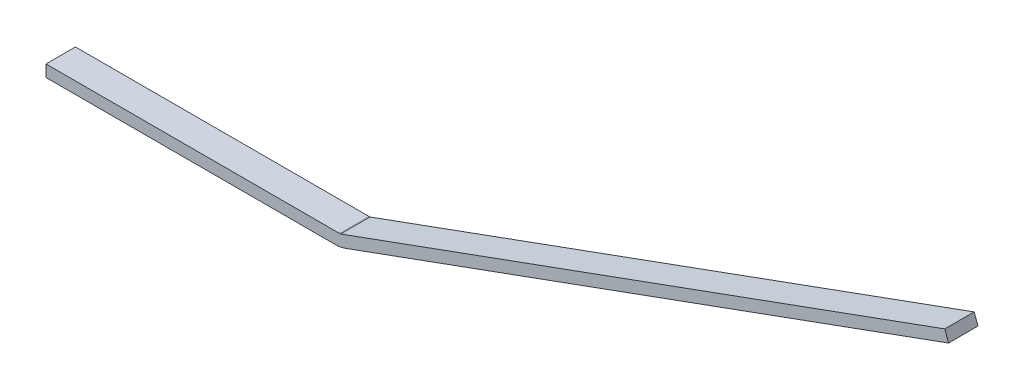
ISO-10303-21;
HEADER;
FILE_DESCRIPTION(('STEP AP214'),'2;1');
FILE_NAME('part.step','',(''),(''),'','','');
FILE_SCHEMA(('AUTOMOTIVE_DESIGN { 1 0 10303 214 1 1 1 1 }'));
ENDSEC;
DATA;
#1=APPLICATION_CONTEXT('core data for automotive mechanical design processes');
#2=APPLICATION_PROTOCOL_DEFINITION('international standard','automotive_design',2000,#1);
#3=PRODUCT_CONTEXT('',#1,'mechanical');
#4=PRODUCT('Part','Part','',(#3));
#5=PRODUCT_RELATED_PRODUCT_CATEGORY('part','',(#4));
#6=PRODUCT_DEFINITION_FORMATION('','',#4);
#7=PRODUCT_DEFINITION_CONTEXT('part definition',#1,'design');
#8=PRODUCT_DEFINITION('design','',#6,#7);
#9=PRODUCT_DEFINITION_SHAPE('','',#8);
#10=(LENGTH_UNIT() NAMED_UNIT(*) SI_UNIT(.MILLI.,.METRE.));
#11=(NAMED_UNIT(*) PLANE_ANGLE_UNIT() SI_UNIT($,.RADIAN.));
#12=(NAMED_UNIT(*) SI_UNIT($,.STERADIAN.) SOLID_ANGLE_UNIT());
#13=UNCERTAINTY_MEASURE_WITH_UNIT(LENGTH_MEASURE(1.E-05),#10,'distance_accuracy_value','');
#14=(GEOMETRIC_REPRESENTATION_CONTEXT(3) GLOBAL_UNCERTAINTY_ASSIGNED_CONTEXT((#13)) GLOBAL_UNIT_ASSIGNED_CONTEXT((#10,
#11,#12)) REPRESENTATION_CONTEXT('',''));
#15=CARTESIAN_POINT('',(0.,0.,0.));
#16=DIRECTION('',(0.,0.,1.));
#17=DIRECTION('',(1.,0.,0.));
#18=AXIS2_PLACEMENT_3D('',#15,#16,#17);
#19=CARTESIAN_POINT('',(-250.,10.,50.));
#20=DIRECTION('',(0.,-1.,0.));
#21=DIRECTION('',(0.,0.,-1.));
#22=AXIS2_PLACEMENT_3D('',#19,#20,#21);
#23=PLANE('',#22);
#24=DIRECTION('',(-1.,0.,0.));
#25=VECTOR('',#24,1.);
#26=CARTESIAN_POINT('',(-250.,10.,50.));
#27=LINE('',#26,#25);
#28=CARTESIAN_POINT('',(248.299352067639,9.99999999999999,50.));
#29=VERTEX_POINT('',#28);
#30=CARTESIAN_POINT('',(-250.,10.,50.));
#31=VERTEX_POINT('',#30);
#32=EDGE_CURVE('E96',#29,#31,#27,.T.);
#33=ORIENTED_EDGE('',*,*,#32,.F.);
#34=DIRECTION('',(0.,0.,1.));
#35=VECTOR('',#34,1.);
#36=CARTESIAN_POINT('',(248.299352067639,10.,50.));
#37=LINE('',#36,#35);
#38=CARTESIAN_POINT('',(248.299352067639,9.99999999999999,0.));
#39=VERTEX_POINT('',#38);
#40=EDGE_CURVE('E115',#29,#39,#37,.F.);
#41=ORIENTED_EDGE('',*,*,#40,.T.);
#42=DIRECTION('',(-1.,0.,0.));
#43=VECTOR('',#42,1.);
#44=CARTESIAN_POINT('',(-250.,10.,0.));
#45=LINE('',#44,#43);
#46=CARTESIAN_POINT('',(-250.,10.,0.));
#47=VERTEX_POINT('',#46);
#48=EDGE_CURVE('E112',#39,#47,#45,.T.);
#49=ORIENTED_EDGE('',*,*,#48,.T.);
#50=DIRECTION('',(0.,0.,-1.));
#51=VECTOR('',#50,1.);
#52=CARTESIAN_POINT('',(-250.,10.,50.));
#53=LINE('',#52,#51);
#54=EDGE_CURVE('E110',#31,#47,#53,.T.);
#55=ORIENTED_EDGE('',*,*,#54,.F.);
#56=EDGE_LOOP('',(#33,#41,#49,#55));
#57=FACE_BOUND('',#56,.T.);
#58=ADVANCED_FACE('F33',(#57),#23,.F.);
#59=CARTESIAN_POINT('',(-250.,-10.,50.));
#60=DIRECTION('',(1.,0.,0.));
#61=DIRECTION('',(0.,0.,-1.));
#62=AXIS2_PLACEMENT_3D('',#59,#60,#61);
#63=PLANE('',#62);
#64=DIRECTION('',(0.,-1.,0.));
#65=VECTOR('',#64,1.);
#66=CARTESIAN_POINT('',(-250.,-10.,0.));
#67=LINE('',#66,#65);
#68=CARTESIAN_POINT('',(-250.,-10.,0.));
#69=VERTEX_POINT('',#68);
#70=EDGE_CURVE('E132',#47,#69,#67,.T.);
#71=ORIENTED_EDGE('',*,*,#70,.T.);
#72=DIRECTION('',(0.,0.,-1.));
#73=VECTOR('',#72,1.);
#74=CARTESIAN_POINT('',(-250.,-10.,50.));
#75=LINE('',#74,#73);
#76=CARTESIAN_POINT('',(-250.,-10.,50.));
#77=VERTEX_POINT('',#76);
#78=EDGE_CURVE('E116',#77,#69,#75,.T.);
#79=ORIENTED_EDGE('',*,*,#78,.F.);
#80=DIRECTION('',(0.,-1.,0.));
#81=VECTOR('',#80,1.);
#82=CARTESIAN_POINT('',(-250.,-10.,50.));
#83=LINE('',#82,#81);
#84=EDGE_CURVE('E100',#31,#77,#83,.T.);
#85=ORIENTED_EDGE('',*,*,#84,.F.);
#86=ORIENTED_EDGE('',*,*,#54,.T.);
#87=EDGE_LOOP('',(#71,#79,#85,#86));
#88=FACE_BOUND('',#87,.T.);
#89=ADVANCED_FACE('F118',(#88),#63,.F.);
#90=CARTESIAN_POINT('',(-250.,-10.,50.));
#91=DIRECTION('',(0.,1.,0.));
#92=DIRECTION('',(0.,0.,1.));
#93=AXIS2_PLACEMENT_3D('',#90,#91,#92);
#94=PLANE('',#93);
#95=DIRECTION('',(1.,0.,0.));
#96=VECTOR('',#95,1.);
#97=CARTESIAN_POINT('',(-250.,-10.,0.));
#98=LINE('',#97,#96);
#99=CARTESIAN_POINT('',(241.183650964577,-10.,0.));
#100=VERTEX_POINT('',#99);
#101=EDGE_CURVE('E134',#69,#100,#98,.T.);
#102=ORIENTED_EDGE('',*,*,#101,.T.);
#103=DIRECTION('',(0.,0.,-1.));
#104=VECTOR('',#103,1.);
#105=CARTESIAN_POINT('',(241.183650964577,-10.,50.));
#106=LINE('',#105,#104);
#107=CARTESIAN_POINT('',(241.183650964577,-10.,50.));
#108=VERTEX_POINT('',#107);
#109=EDGE_CURVE('E11',#100,#108,#106,.F.);
#110=ORIENTED_EDGE('',*,*,#109,.T.);
#111=DIRECTION('',(1.,0.,0.));
#112=VECTOR('',#111,1.);
#113=CARTESIAN_POINT('',(-250.,-10.,50.));
#114=LINE('',#113,#112);
#115=EDGE_CURVE('E120',#77,#108,#114,.T.);
#116=ORIENTED_EDGE('',*,*,#115,.F.);
#117=ORIENTED_EDGE('',*,*,#78,.T.);
#118=EDGE_LOOP('',(#102,#110,#116,#117));
#119=FACE_BOUND('',#118,.T.);
#120=ADVANCED_FACE('F179',(#119),#94,.F.);
#121=CARTESIAN_POINT('',(250.,-10.,50.));
#122=DIRECTION('',(-0.342020143325669,0.939692620785908,0.));
#123=DIRECTION('',(-0.939692620785908,-0.342020143325669,0.));
#124=AXIS2_PLACEMENT_3D('',#121,#122,#123);
#125=PLANE('',#124);
#126=DIRECTION('',(0.939692620785908,0.342020143325669,0.));
#127=VECTOR('',#126,1.);
#128=CARTESIAN_POINT('',(250.,-10.,50.));
#129=LINE('',#128,#127);
#130=CARTESIAN_POINT('',(258.28465813086,-6.98463103929541,50.));
#131=VERTEX_POINT('',#130);
#132=CARTESIAN_POINT('',(1282.52634812861,365.808856814396,50.));
#133=VERTEX_POINT('',#132);
#134=EDGE_CURVE('E122',#131,#133,#129,.T.);
#135=ORIENTED_EDGE('',*,*,#134,.F.);
#136=DIRECTION('',(0.,0.,-1.));
#137=VECTOR('',#136,1.);
#138=CARTESIAN_POINT('',(258.28465813086,-6.98463103929541,50.));
#139=LINE('',#138,#137);
#140=CARTESIAN_POINT('',(258.28465813086,-6.98463103929541,0.));
#141=VERTEX_POINT('',#140);
#142=EDGE_CURVE('E41',#131,#141,#139,.T.);
#143=ORIENTED_EDGE('',*,*,#142,.T.);
#144=DIRECTION('',(0.939692620785908,0.342020143325669,0.));
#145=VECTOR('',#144,1.);
#146=CARTESIAN_POINT('',(250.,-10.,0.));
#147=LINE('',#146,#145);
#148=CARTESIAN_POINT('',(1282.52634812861,365.808856814396,0.));
#149=VERTEX_POINT('',#148);
#150=EDGE_CURVE('E136',#141,#149,#147,.T.);
#151=ORIENTED_EDGE('',*,*,#150,.T.);
#152=DIRECTION('',(0.,0.,-1.));
#153=VECTOR('',#152,1.);
#154=CARTESIAN_POINT('',(1282.52634812861,365.808856814396,50.));
#155=LINE('',#154,#153);
#156=EDGE_CURVE('E147',#133,#149,#155,.T.);
#157=ORIENTED_EDGE('',*,*,#156,.F.);
#158=EDGE_LOOP('',(#135,#143,#151,#157));
#159=FACE_BOUND('',#158,.T.);
#160=ADVANCED_FACE('F161',(#159),#125,.F.);
#161=CARTESIAN_POINT('',(1282.52634812861,365.808856814396,50.));
#162=DIRECTION('',(-0.939692620785906,-0.342020143325676,0.));
#163=DIRECTION('',(0.342020143325676,-0.939692620785906,0.));
#164=AXIS2_PLACEMENT_3D('',#161,#162,#163);
#165=PLANE('',#164);
#166=DIRECTION('',(-0.342020143325676,0.939692620785906,0.));
#167=VECTOR('',#166,1.);
#168=CARTESIAN_POINT('',(1282.52634812861,365.808856814396,0.));
#169=LINE('',#168,#167);
#170=CARTESIAN_POINT('',(1276.10777008422,383.443755056345,0.));
#171=VERTEX_POINT('',#170);
#172=EDGE_CURVE('E138',#149,#171,#169,.T.);
#173=ORIENTED_EDGE('',*,*,#172,.T.);
#174=DIRECTION('',(0.,0.,-1.));
#175=VECTOR('',#174,1.);
#176=CARTESIAN_POINT('',(1276.10777008422,383.443755056345,50.));
#177=LINE('',#176,#175);
#178=CARTESIAN_POINT('',(1276.10777008422,383.443755056345,50.));
#179=VERTEX_POINT('',#178);
#180=EDGE_CURVE('E144',#179,#171,#177,.T.);
#181=ORIENTED_EDGE('',*,*,#180,.F.);
#182=DIRECTION('',(-0.342020143325676,0.939692620785906,0.));
#183=VECTOR('',#182,1.);
#184=CARTESIAN_POINT('',(1282.52634812861,365.808856814396,50.));
#185=LINE('',#184,#183);
#186=EDGE_CURVE('E126',#133,#179,#185,.T.);
#187=ORIENTED_EDGE('',*,*,#186,.F.);
#188=ORIENTED_EDGE('',*,*,#156,.T.);
#189=EDGE_LOOP('',(#173,#181,#187,#188));
#190=FACE_BOUND('',#189,.T.);
#191=ADVANCED_FACE('F171',(#190),#165,.F.);
#192=CARTESIAN_POINT('',(250.,9.97106959641904,50.));
#193=DIRECTION('',(0.342020143325669,-0.939692620785908,0.));
#194=DIRECTION('',(0.939692620785908,0.342020143325669,0.));
#195=AXIS2_PLACEMENT_3D('',#192,#193,#194);
#196=PLANE('',#195);
#197=DIRECTION('',(-0.939692620785908,-0.342020143325669,0.));
#198=VECTOR('',#197,1.);
#199=CARTESIAN_POINT('',(250.,9.97106959641904,0.));
#200=LINE('',#199,#198);
#201=CARTESIAN_POINT('',(250.,9.97106959641904,0.));
#202=VERTEX_POINT('',#201);
#203=EDGE_CURVE('E107',#171,#202,#200,.T.);
#204=ORIENTED_EDGE('',*,*,#203,.T.);
#205=DIRECTION('',(0.,0.,-1.));
#206=VECTOR('',#205,1.);
#207=CARTESIAN_POINT('',(250.,9.97106959641904,50.));
#208=LINE('',#207,#206);
#209=CARTESIAN_POINT('',(250.,9.97106959641904,50.));
#210=VERTEX_POINT('',#209);
#211=EDGE_CURVE('E130',#210,#202,#208,.T.);
#212=ORIENTED_EDGE('',*,*,#211,.F.);
#213=DIRECTION('',(-0.939692620785908,-0.342020143325669,0.));
#214=VECTOR('',#213,1.);
#215=CARTESIAN_POINT('',(250.,9.97106959641904,50.));
#216=LINE('',#215,#214);
#217=EDGE_CURVE('E128',#179,#210,#216,.T.);
#218=ORIENTED_EDGE('',*,*,#217,.F.);
#219=ORIENTED_EDGE('',*,*,#180,.T.);
#220=EDGE_LOOP('',(#204,#212,#218,#219));
#221=FACE_BOUND('',#220,.T.);
#222=ADVANCED_FACE('F175',(#221),#196,.F.);
#223=CARTESIAN_POINT('',(0.,0.,50.));
#224=DIRECTION('',(0.,0.,-1.));
#225=DIRECTION('',(-1.,0.,0.));
#226=AXIS2_PLACEMENT_3D('',#223,#224,#225);
#227=PLANE('',#226);
#228=ORIENTED_EDGE('',*,*,#217,.T.);
#229=CARTESIAN_POINT('',(248.299352067639,-40.,50.));
#230=DIRECTION('',(0.,0.,-1.));
#231=DIRECTION('',(-1.,0.,0.));
#232=AXIS2_PLACEMENT_3D('',#229,#230,#231);
#233=CIRCLE('',#232,50.);
#234=EDGE_CURVE('E103',#210,#29,#233,.F.);
#235=ORIENTED_EDGE('',*,*,#234,.T.);
#236=ORIENTED_EDGE('',*,*,#32,.T.);
#237=ORIENTED_EDGE('',*,*,#84,.T.);
#238=ORIENTED_EDGE('',*,*,#115,.T.);
#239=CARTESIAN_POINT('',(241.183650964577,40.,50.));
#240=DIRECTION('',(0.,0.,-1.));
#241=DIRECTION('',(-1.,0.,0.));
#242=AXIS2_PLACEMENT_3D('',#239,#240,#241);
#243=CIRCLE('',#242,50.);
#244=EDGE_CURVE('E48',#108,#131,#243,.F.);
#245=ORIENTED_EDGE('',*,*,#244,.T.);
#246=ORIENTED_EDGE('',*,*,#134,.T.);
#247=ORIENTED_EDGE('',*,*,#186,.T.);
#248=EDGE_LOOP('',(#228,#235,#236,#237,#238,#245,#246,#247));
#249=FACE_BOUND('',#248,.T.);
#250=ADVANCED_FACE('F98',(#249),#227,.F.);
#251=CARTESIAN_POINT('',(0.,0.,0.));
#252=DIRECTION('',(0.,0.,-1.));
#253=DIRECTION('',(-1.,0.,0.));
#254=AXIS2_PLACEMENT_3D('',#251,#252,#253);
#255=PLANE('',#254);
#256=ORIENTED_EDGE('',*,*,#48,.F.);
#257=CARTESIAN_POINT('',(248.299352067639,-40.,0.));
#258=DIRECTION('',(0.,0.,-1.));
#259=DIRECTION('',(-1.,0.,0.));
#260=AXIS2_PLACEMENT_3D('',#257,#258,#259);
#261=CIRCLE('',#260,50.);
#262=EDGE_CURVE('E154',#39,#202,#261,.T.);
#263=ORIENTED_EDGE('',*,*,#262,.T.);
#264=ORIENTED_EDGE('',*,*,#203,.F.);
#265=ORIENTED_EDGE('',*,*,#172,.F.);
#266=ORIENTED_EDGE('',*,*,#150,.F.);
#267=CARTESIAN_POINT('',(241.183650964577,40.,0.));
#268=DIRECTION('',(0.,0.,-1.));
#269=DIRECTION('',(-1.,0.,0.));
#270=AXIS2_PLACEMENT_3D('',#267,#268,#269);
#271=CIRCLE('',#270,50.);
#272=EDGE_CURVE('E152',#141,#100,#271,.T.);
#273=ORIENTED_EDGE('',*,*,#272,.T.);
#274=ORIENTED_EDGE('',*,*,#101,.F.);
#275=ORIENTED_EDGE('',*,*,#70,.F.);
#276=EDGE_LOOP('',(#256,#263,#264,#265,#266,#273,#274,#275));
#277=FACE_BOUND('',#276,.T.);
#278=ADVANCED_FACE('F166',(#277),#255,.T.);
#279=CARTESIAN_POINT('',(248.299352067639,-40.,50.));
#280=DIRECTION('',(0.,0.,1.));
#281=DIRECTION('',(1.,0.,0.));
#282=AXIS2_PLACEMENT_3D('',#279,#280,#281);
#283=CYLINDRICAL_SURFACE('',#282,50.);
#284=ORIENTED_EDGE('',*,*,#234,.F.);
#285=ORIENTED_EDGE('',*,*,#211,.T.);
#286=ORIENTED_EDGE('',*,*,#262,.F.);
#287=ORIENTED_EDGE('',*,*,#40,.F.);
#288=EDGE_LOOP('',(#284,#285,#286,#287));
#289=FACE_BOUND('',#288,.T.);
#290=ADVANCED_FACE('F178',(#289),#283,.T.);
#291=CARTESIAN_POINT('',(241.183650964577,40.,50.));
#292=DIRECTION('',(0.,0.,-1.));
#293=DIRECTION('',(-1.,0.,0.));
#294=AXIS2_PLACEMENT_3D('',#291,#292,#293);
#295=CYLINDRICAL_SURFACE('',#294,50.);
#296=ORIENTED_EDGE('',*,*,#244,.F.);
#297=ORIENTED_EDGE('',*,*,#109,.F.);
#298=ORIENTED_EDGE('',*,*,#272,.F.);
#299=ORIENTED_EDGE('',*,*,#142,.F.);
#300=EDGE_LOOP('',(#296,#297,#298,#299));
#301=FACE_BOUND('',#300,.T.);
#302=ADVANCED_FACE('F35',(#301),#295,.T.);
#303=CLOSED_SHELL('',(#58,#89,#120,#160,#191,#222,#250,#278,#290,#302));
#304=MANIFOLD_SOLID_BREP('B2',#303);
#305=ADVANCED_BREP_SHAPE_REPRESENTATION('',(#18,#304),#14);
#306=SHAPE_DEFINITION_REPRESENTATION(#9,#305);
ENDSEC;
END-ISO-10303-21;
